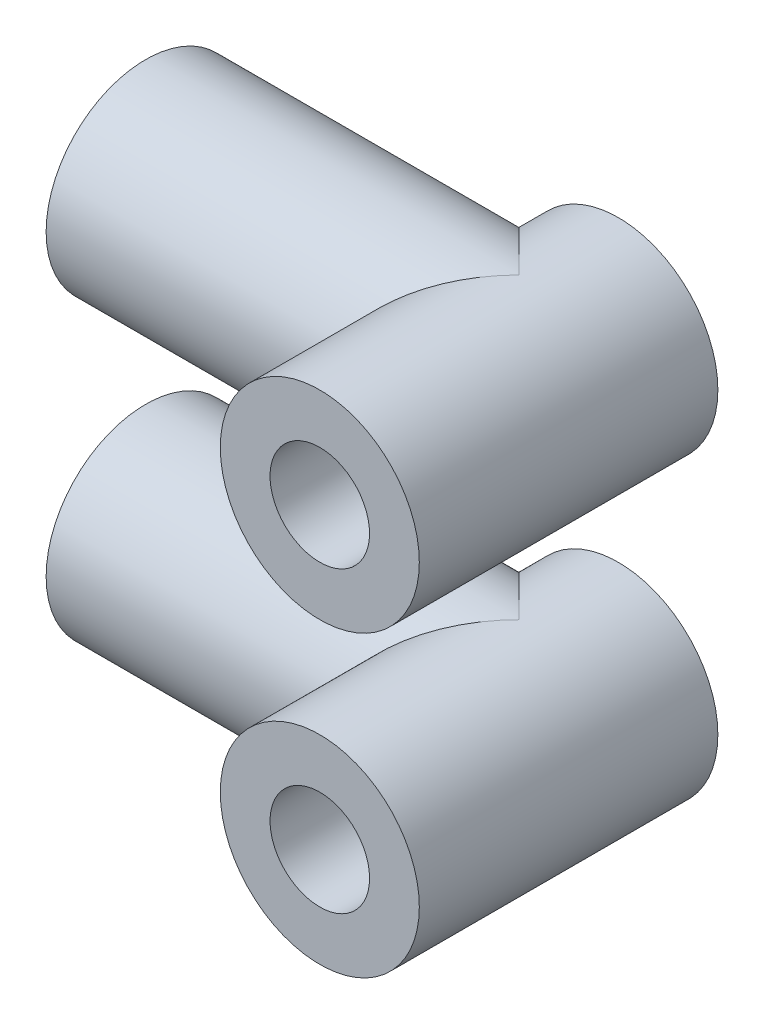
ISO-10303-21;
HEADER;
FILE_DESCRIPTION(('STEP AP214'),'2;1');
FILE_NAME('part.step','',(''),(''),'','','');
FILE_SCHEMA(('AUTOMOTIVE_DESIGN { 1 0 10303 214 1 1 1 1 }'));
ENDSEC;
DATA;
#1=APPLICATION_CONTEXT('core data for automotive mechanical design processes');
#2=APPLICATION_PROTOCOL_DEFINITION('international standard','automotive_design',2000,#1);
#3=PRODUCT_CONTEXT('',#1,'mechanical');
#4=PRODUCT('Part','Part','',(#3));
#5=PRODUCT_RELATED_PRODUCT_CATEGORY('part','',(#4));
#6=PRODUCT_DEFINITION_FORMATION('','',#4);
#7=PRODUCT_DEFINITION_CONTEXT('part definition',#1,'design');
#8=PRODUCT_DEFINITION('design','',#6,#7);
#9=PRODUCT_DEFINITION_SHAPE('','',#8);
#10=(LENGTH_UNIT() NAMED_UNIT(*) SI_UNIT(.MILLI.,.METRE.));
#11=(NAMED_UNIT(*) PLANE_ANGLE_UNIT() SI_UNIT($,.RADIAN.));
#12=(NAMED_UNIT(*) SI_UNIT($,.STERADIAN.) SOLID_ANGLE_UNIT());
#13=UNCERTAINTY_MEASURE_WITH_UNIT(LENGTH_MEASURE(1.E-05),#10,'distance_accuracy_value','');
#14=(GEOMETRIC_REPRESENTATION_CONTEXT(3) GLOBAL_UNCERTAINTY_ASSIGNED_CONTEXT((#13)) GLOBAL_UNIT_ASSIGNED_CONTEXT((#10,
#11,#12)) REPRESENTATION_CONTEXT('',''));
#15=CARTESIAN_POINT('',(0.,0.,0.));
#16=DIRECTION('',(0.,0.,1.));
#17=DIRECTION('',(1.,0.,0.));
#18=AXIS2_PLACEMENT_3D('',#15,#16,#17);
#19=CARTESIAN_POINT('',(0.,12.,12.));
#20=DIRECTION('',(0.,0.,1.));
#21=DIRECTION('',(1.,0.,0.));
#22=AXIS2_PLACEMENT_3D('',#19,#20,#21);
#23=PLANE('',#22);
#24=CARTESIAN_POINT('',(0.,12.,12.));
#25=DIRECTION('',(0.,0.,-1.));
#26=DIRECTION('',(1.,0.,0.));
#27=AXIS2_PLACEMENT_3D('',#24,#25,#26);
#28=CIRCLE('',#27,4.);
#29=CARTESIAN_POINT('',(4.,12.,12.));
#30=VERTEX_POINT('',#29);
#31=EDGE_CURVE('E12',#30,#30,#28,.T.);
#32=ORIENTED_EDGE('',*,*,#31,.F.);
#33=EDGE_LOOP('',(#32));
#34=FACE_BOUND('',#33,.T.);
#35=CARTESIAN_POINT('',(0.,12.,12.));
#36=DIRECTION('',(0.,0.,-1.));
#37=DIRECTION('',(1.,0.,0.));
#38=AXIS2_PLACEMENT_3D('',#35,#36,#37);
#39=CIRCLE('',#38,2.);
#40=CARTESIAN_POINT('',(2.,12.,12.));
#41=VERTEX_POINT('',#40);
#42=EDGE_CURVE('E95',#41,#41,#39,.T.);
#43=ORIENTED_EDGE('',*,*,#42,.T.);
#44=EDGE_LOOP('',(#43));
#45=FACE_BOUND('',#44,.T.);
#46=ADVANCED_FACE('F47',(#34,#45),#23,.T.);
#47=CARTESIAN_POINT('',(0.,12.,0.));
#48=DIRECTION('',(0.,0.,1.));
#49=DIRECTION('',(1.,0.,0.));
#50=AXIS2_PLACEMENT_3D('',#47,#48,#49);
#51=PLANE('',#50);
#52=CARTESIAN_POINT('',(0.,12.,0.));
#53=DIRECTION('',(0.,0.,-1.));
#54=DIRECTION('',(1.,0.,0.));
#55=AXIS2_PLACEMENT_3D('',#52,#53,#54);
#56=CIRCLE('',#55,2.);
#57=CARTESIAN_POINT('',(2.,12.,0.));
#58=VERTEX_POINT('',#57);
#59=EDGE_CURVE('E98',#58,#58,#56,.T.);
#60=ORIENTED_EDGE('',*,*,#59,.F.);
#61=EDGE_LOOP('',(#60));
#62=FACE_BOUND('',#61,.T.);
#63=CARTESIAN_POINT('',(0.,12.,0.));
#64=DIRECTION('',(0.,0.,-1.));
#65=DIRECTION('',(1.,0.,0.));
#66=AXIS2_PLACEMENT_3D('',#63,#64,#65);
#67=CIRCLE('',#66,4.);
#68=CARTESIAN_POINT('',(-4.,12.,0.));
#69=VERTEX_POINT('',#68);
#70=EDGE_CURVE('E51',#69,#69,#67,.T.);
#71=ORIENTED_EDGE('',*,*,#70,.T.);
#72=EDGE_LOOP('',(#71));
#73=FACE_BOUND('',#72,.T.);
#74=ADVANCED_FACE('F106',(#62,#73),#51,.F.);
#75=CARTESIAN_POINT('',(0.,12.,12.));
#76=DIRECTION('',(0.,0.,-1.));
#77=DIRECTION('',(-1.,0.,0.));
#78=AXIS2_PLACEMENT_3D('',#75,#76,#77);
#79=CYLINDRICAL_SURFACE('',#78,4.);
#80=ORIENTED_EDGE('',*,*,#31,.T.);
#81=EDGE_LOOP('',(#80));
#82=FACE_BOUND('',#81,.T.);
#83=CARTESIAN_POINT('',(0.,12.,4.));
#84=DIRECTION('',(0.707106781186547,0.,0.707106781186547));
#85=DIRECTION('',(0.707106781186547,0.,-0.707106781186547));
#86=AXIS2_PLACEMENT_3D('',#83,#84,#85);
#87=ELLIPSE('',#86,5.65685424949238,4.);
#88=CARTESIAN_POINT('',(0.,8.,4.));
#89=VERTEX_POINT('',#88);
#90=CARTESIAN_POINT('',(0.,16.,4.));
#91=VERTEX_POINT('',#90);
#92=EDGE_CURVE('E91',#89,#91,#87,.F.);
#93=ORIENTED_EDGE('',*,*,#92,.F.);
#94=CARTESIAN_POINT('',(0.,12.,4.));
#95=DIRECTION('',(-0.707106781186547,0.,0.707106781186547));
#96=DIRECTION('',(-0.707106781186547,0.,-0.707106781186547));
#97=AXIS2_PLACEMENT_3D('',#94,#95,#96);
#98=ELLIPSE('',#97,5.65685424949238,4.);
#99=EDGE_CURVE('E93',#69,#89,#98,.T.);
#100=ORIENTED_EDGE('',*,*,#99,.F.);
#101=ORIENTED_EDGE('',*,*,#70,.F.);
#102=EDGE_CURVE('E69',#91,#69,#98,.T.);
#103=ORIENTED_EDGE('',*,*,#102,.F.);
#104=EDGE_LOOP('',(#93,#100,#101,#103));
#105=FACE_BOUND('',#104,.T.);
#106=ADVANCED_FACE('F49',(#82,#105),#79,.T.);
#107=CARTESIAN_POINT('',(0.,12.,12.));
#108=DIRECTION('',(0.,0.,-1.));
#109=DIRECTION('',(-1.,0.,0.));
#110=AXIS2_PLACEMENT_3D('',#107,#108,#109);
#111=CYLINDRICAL_SURFACE('',#110,2.);
#112=CARTESIAN_POINT('',(0.,12.,4.));
#113=DIRECTION('',(0.707106781186547,0.,0.707106781186547));
#114=DIRECTION('',(0.707106781186547,0.,-0.707106781186547));
#115=AXIS2_PLACEMENT_3D('',#112,#113,#114);
#116=ELLIPSE('',#115,2.82842712474619,2.);
#117=CARTESIAN_POINT('',(0.,10.,4.));
#118=VERTEX_POINT('',#117);
#119=CARTESIAN_POINT('',(0.,14.,4.));
#120=VERTEX_POINT('',#119);
#121=EDGE_CURVE('E80',#118,#120,#116,.F.);
#122=ORIENTED_EDGE('',*,*,#121,.T.);
#123=CARTESIAN_POINT('',(0.,12.,4.));
#124=DIRECTION('',(-0.707106781186547,0.,0.707106781186547));
#125=DIRECTION('',(-0.707106781186547,0.,-0.707106781186547));
#126=AXIS2_PLACEMENT_3D('',#123,#124,#125);
#127=ELLIPSE('',#126,2.82842712474619,2.);
#128=EDGE_CURVE('E61',#120,#118,#127,.T.);
#129=ORIENTED_EDGE('',*,*,#128,.T.);
#130=EDGE_LOOP('',(#122,#129));
#131=FACE_BOUND('',#130,.T.);
#132=ORIENTED_EDGE('',*,*,#59,.T.);
#133=EDGE_LOOP('',(#132));
#134=FACE_BOUND('',#133,.T.);
#135=ORIENTED_EDGE('',*,*,#42,.F.);
#136=EDGE_LOOP('',(#135));
#137=FACE_BOUND('',#136,.T.);
#138=ADVANCED_FACE('F78',(#131,#134,#137),#111,.F.);
#139=CARTESIAN_POINT('',(-15.,12.,4.));
#140=DIRECTION('',(1.,0.,0.));
#141=DIRECTION('',(0.,0.,-1.));
#142=AXIS2_PLACEMENT_3D('',#139,#140,#141);
#143=CYLINDRICAL_SURFACE('',#142,4.);
#144=CARTESIAN_POINT('',(-15.,12.,4.));
#145=DIRECTION('',(-1.,0.,0.));
#146=DIRECTION('',(0.,0.,-1.));
#147=AXIS2_PLACEMENT_3D('',#144,#145,#146);
#148=CIRCLE('',#147,4.);
#149=CARTESIAN_POINT('',(-15.,12.,0.));
#150=VERTEX_POINT('',#149);
#151=EDGE_CURVE('E86',#150,#150,#148,.T.);
#152=ORIENTED_EDGE('',*,*,#151,.F.);
#153=EDGE_LOOP('',(#152));
#154=FACE_BOUND('',#153,.T.);
#155=ORIENTED_EDGE('',*,*,#102,.T.);
#156=ORIENTED_EDGE('',*,*,#99,.T.);
#157=ORIENTED_EDGE('',*,*,#92,.T.);
#158=EDGE_LOOP('',(#155,#156,#157));
#159=FACE_BOUND('',#158,.T.);
#160=ADVANCED_FACE('F103',(#154,#159),#143,.T.);
#161=CARTESIAN_POINT('',(-15.,12.,4.));
#162=DIRECTION('',(1.,0.,0.));
#163=DIRECTION('',(0.,0.,-1.));
#164=AXIS2_PLACEMENT_3D('',#161,#162,#163);
#165=CYLINDRICAL_SURFACE('',#164,2.);
#166=CARTESIAN_POINT('',(-15.,12.,4.));
#167=DIRECTION('',(-1.,0.,0.));
#168=DIRECTION('',(0.,0.,-1.));
#169=AXIS2_PLACEMENT_3D('',#166,#167,#168);
#170=CIRCLE('',#169,2.);
#171=CARTESIAN_POINT('',(-15.,12.,2.));
#172=VERTEX_POINT('',#171);
#173=EDGE_CURVE('E83',#172,#172,#170,.T.);
#174=ORIENTED_EDGE('',*,*,#173,.T.);
#175=EDGE_LOOP('',(#174));
#176=FACE_BOUND('',#175,.T.);
#177=ORIENTED_EDGE('',*,*,#121,.F.);
#178=ORIENTED_EDGE('',*,*,#128,.F.);
#179=EDGE_LOOP('',(#177,#178));
#180=FACE_BOUND('',#179,.T.);
#181=ADVANCED_FACE('F82',(#176,#180),#165,.F.);
#182=CARTESIAN_POINT('',(-15.,12.,4.));
#183=DIRECTION('',(1.,0.,0.));
#184=DIRECTION('',(0.,0.,-1.));
#185=AXIS2_PLACEMENT_3D('',#182,#183,#184);
#186=PLANE('',#185);
#187=ORIENTED_EDGE('',*,*,#173,.F.);
#188=EDGE_LOOP('',(#187));
#189=FACE_BOUND('',#188,.T.);
#190=ORIENTED_EDGE('',*,*,#151,.T.);
#191=EDGE_LOOP('',(#190));
#192=FACE_BOUND('',#191,.T.);
#193=ADVANCED_FACE('F122',(#189,#192),#186,.F.);
#194=CLOSED_SHELL('',(#46,#74,#106,#138,#160,#181,#193));
#195=MANIFOLD_SOLID_BREP('B2_NOT_SHOWN',#194);
#196=CARTESIAN_POINT('',(0.,0.,12.));
#197=DIRECTION('',(0.,0.,1.));
#198=DIRECTION('',(1.,0.,0.));
#199=AXIS2_PLACEMENT_3D('',#196,#197,#198);
#200=PLANE('',#199);
#201=CARTESIAN_POINT('',(0.,0.,12.));
#202=DIRECTION('',(0.,0.,1.));
#203=DIRECTION('',(1.,0.,0.));
#204=AXIS2_PLACEMENT_3D('',#201,#202,#203);
#205=CIRCLE('',#204,4.);
#206=CARTESIAN_POINT('',(4.,0.,12.));
#207=VERTEX_POINT('',#206);
#208=EDGE_CURVE('E45',#207,#207,#205,.T.);
#209=ORIENTED_EDGE('',*,*,#208,.T.);
#210=EDGE_LOOP('',(#209));
#211=FACE_BOUND('',#210,.T.);
#212=CARTESIAN_POINT('',(0.,0.,12.));
#213=DIRECTION('',(0.,0.,1.));
#214=DIRECTION('',(1.,0.,0.));
#215=AXIS2_PLACEMENT_3D('',#212,#213,#214);
#216=CIRCLE('',#215,2.);
#217=CARTESIAN_POINT('',(2.,0.,12.));
#218=VERTEX_POINT('',#217);
#219=EDGE_CURVE('E231',#218,#218,#216,.T.);
#220=ORIENTED_EDGE('',*,*,#219,.F.);
#221=EDGE_LOOP('',(#220));
#222=FACE_BOUND('',#221,.T.);
#223=ADVANCED_FACE('F183',(#211,#222),#200,.T.);
#224=CARTESIAN_POINT('',(0.,0.,0.));
#225=DIRECTION('',(0.,0.,1.));
#226=DIRECTION('',(1.,0.,0.));
#227=AXIS2_PLACEMENT_3D('',#224,#225,#226);
#228=PLANE('',#227);
#229=CARTESIAN_POINT('',(0.,0.,0.));
#230=DIRECTION('',(0.,0.,1.));
#231=DIRECTION('',(1.,0.,0.));
#232=AXIS2_PLACEMENT_3D('',#229,#230,#231);
#233=CIRCLE('',#232,2.);
#234=CARTESIAN_POINT('',(2.,0.,0.));
#235=VERTEX_POINT('',#234);
#236=EDGE_CURVE('E234',#235,#235,#233,.T.);
#237=ORIENTED_EDGE('',*,*,#236,.T.);
#238=EDGE_LOOP('',(#237));
#239=FACE_BOUND('',#238,.T.);
#240=CARTESIAN_POINT('',(0.,0.,0.));
#241=DIRECTION('',(0.,0.,1.));
#242=DIRECTION('',(1.,0.,0.));
#243=AXIS2_PLACEMENT_3D('',#240,#241,#242);
#244=CIRCLE('',#243,4.);
#245=CARTESIAN_POINT('',(-4.,0.,0.));
#246=VERTEX_POINT('',#245);
#247=EDGE_CURVE('E187',#246,#246,#244,.T.);
#248=ORIENTED_EDGE('',*,*,#247,.F.);
#249=EDGE_LOOP('',(#248));
#250=FACE_BOUND('',#249,.T.);
#251=ADVANCED_FACE('F255',(#239,#250),#228,.F.);
#252=CARTESIAN_POINT('',(0.,0.,12.));
#253=DIRECTION('',(0.,0.,-1.));
#254=DIRECTION('',(-1.,0.,0.));
#255=AXIS2_PLACEMENT_3D('',#252,#253,#254);
#256=CYLINDRICAL_SURFACE('',#255,4.);
#257=ORIENTED_EDGE('',*,*,#208,.F.);
#258=EDGE_LOOP('',(#257));
#259=FACE_BOUND('',#258,.T.);
#260=CARTESIAN_POINT('',(0.,0.,4.));
#261=DIRECTION('',(-0.707106781186547,0.,-0.707106781186547));
#262=DIRECTION('',(0.707106781186547,0.,-0.707106781186547));
#263=AXIS2_PLACEMENT_3D('',#260,#261,#262);
#264=ELLIPSE('',#263,5.65685424949238,4.);
#265=CARTESIAN_POINT('',(0.,4.,4.));
#266=VERTEX_POINT('',#265);
#267=CARTESIAN_POINT('',(0.,-4.,4.));
#268=VERTEX_POINT('',#267);
#269=EDGE_CURVE('E226',#266,#268,#264,.F.);
#270=ORIENTED_EDGE('',*,*,#269,.T.);
#271=CARTESIAN_POINT('',(0.,0.,4.));
#272=DIRECTION('',(0.707106781186547,0.,-0.707106781186547));
#273=DIRECTION('',(-0.707106781186547,0.,-0.707106781186547));
#274=AXIS2_PLACEMENT_3D('',#271,#272,#273);
#275=ELLIPSE('',#274,5.65685424949238,4.);
#276=EDGE_CURVE('E205',#268,#246,#275,.T.);
#277=ORIENTED_EDGE('',*,*,#276,.T.);
#278=ORIENTED_EDGE('',*,*,#247,.T.);
#279=EDGE_CURVE('E228',#246,#266,#275,.T.);
#280=ORIENTED_EDGE('',*,*,#279,.T.);
#281=EDGE_LOOP('',(#270,#277,#278,#280));
#282=FACE_BOUND('',#281,.T.);
#283=ADVANCED_FACE('F185',(#259,#282),#256,.T.);
#284=CARTESIAN_POINT('',(0.,0.,12.));
#285=DIRECTION('',(0.,0.,-1.));
#286=DIRECTION('',(-1.,0.,0.));
#287=AXIS2_PLACEMENT_3D('',#284,#285,#286);
#288=CYLINDRICAL_SURFACE('',#287,2.);
#289=CARTESIAN_POINT('',(0.,0.,4.));
#290=DIRECTION('',(-0.707106781186547,0.,-0.707106781186547));
#291=DIRECTION('',(0.707106781186547,0.,-0.707106781186547));
#292=AXIS2_PLACEMENT_3D('',#289,#290,#291);
#293=ELLIPSE('',#292,2.82842712474619,2.);
#294=CARTESIAN_POINT('',(0.,2.,4.));
#295=VERTEX_POINT('',#294);
#296=CARTESIAN_POINT('',(0.,-2.,4.));
#297=VERTEX_POINT('',#296);
#298=EDGE_CURVE('E197',#295,#297,#293,.F.);
#299=ORIENTED_EDGE('',*,*,#298,.F.);
#300=CARTESIAN_POINT('',(0.,0.,4.));
#301=DIRECTION('',(0.707106781186547,0.,-0.707106781186547));
#302=DIRECTION('',(-0.707106781186547,0.,-0.707106781186547));
#303=AXIS2_PLACEMENT_3D('',#300,#301,#302);
#304=ELLIPSE('',#303,2.82842712474619,2.);
#305=EDGE_CURVE('E212',#297,#295,#304,.T.);
#306=ORIENTED_EDGE('',*,*,#305,.F.);
#307=EDGE_LOOP('',(#299,#306));
#308=FACE_BOUND('',#307,.T.);
#309=ORIENTED_EDGE('',*,*,#236,.F.);
#310=EDGE_LOOP('',(#309));
#311=FACE_BOUND('',#310,.T.);
#312=ORIENTED_EDGE('',*,*,#219,.T.);
#313=EDGE_LOOP('',(#312));
#314=FACE_BOUND('',#313,.T.);
#315=ADVANCED_FACE('F216',(#308,#311,#314),#288,.F.);
#316=CARTESIAN_POINT('',(-15.,0.,4.));
#317=DIRECTION('',(1.,0.,0.));
#318=DIRECTION('',(0.,0.,-1.));
#319=AXIS2_PLACEMENT_3D('',#316,#317,#318);
#320=CYLINDRICAL_SURFACE('',#319,4.);
#321=CARTESIAN_POINT('',(-15.,0.,4.));
#322=DIRECTION('',(1.,0.,0.));
#323=DIRECTION('',(0.,0.,-1.));
#324=AXIS2_PLACEMENT_3D('',#321,#322,#323);
#325=CIRCLE('',#324,4.);
#326=CARTESIAN_POINT('',(-15.,0.,0.));
#327=VERTEX_POINT('',#326);
#328=EDGE_CURVE('E221',#327,#327,#325,.T.);
#329=ORIENTED_EDGE('',*,*,#328,.T.);
#330=EDGE_LOOP('',(#329));
#331=FACE_BOUND('',#330,.T.);
#332=ORIENTED_EDGE('',*,*,#276,.F.);
#333=ORIENTED_EDGE('',*,*,#269,.F.);
#334=ORIENTED_EDGE('',*,*,#279,.F.);
#335=EDGE_LOOP('',(#332,#333,#334));
#336=FACE_BOUND('',#335,.T.);
#337=ADVANCED_FACE('F241',(#331,#336),#320,.T.);
#338=CARTESIAN_POINT('',(-15.,0.,4.));
#339=DIRECTION('',(1.,0.,0.));
#340=DIRECTION('',(0.,0.,-1.));
#341=AXIS2_PLACEMENT_3D('',#338,#339,#340);
#342=CYLINDRICAL_SURFACE('',#341,2.);
#343=CARTESIAN_POINT('',(-15.,0.,4.));
#344=DIRECTION('',(1.,0.,0.));
#345=DIRECTION('',(0.,0.,-1.));
#346=AXIS2_PLACEMENT_3D('',#343,#344,#345);
#347=CIRCLE('',#346,2.);
#348=CARTESIAN_POINT('',(-15.,0.,2.));
#349=VERTEX_POINT('',#348);
#350=EDGE_CURVE('E218',#349,#349,#347,.T.);
#351=ORIENTED_EDGE('',*,*,#350,.F.);
#352=EDGE_LOOP('',(#351));
#353=FACE_BOUND('',#352,.T.);
#354=ORIENTED_EDGE('',*,*,#298,.T.);
#355=ORIENTED_EDGE('',*,*,#305,.T.);
#356=EDGE_LOOP('',(#354,#355));
#357=FACE_BOUND('',#356,.T.);
#358=ADVANCED_FACE('F213',(#353,#357),#342,.F.);
#359=CARTESIAN_POINT('',(-15.,0.,4.));
#360=DIRECTION('',(1.,0.,0.));
#361=DIRECTION('',(0.,0.,-1.));
#362=AXIS2_PLACEMENT_3D('',#359,#360,#361);
#363=PLANE('',#362);
#364=ORIENTED_EDGE('',*,*,#350,.T.);
#365=EDGE_LOOP('',(#364));
#366=FACE_BOUND('',#365,.T.);
#367=ORIENTED_EDGE('',*,*,#328,.F.);
#368=EDGE_LOOP('',(#367));
#369=FACE_BOUND('',#368,.T.);
#370=ADVANCED_FACE('F249',(#366,#369),#363,.F.);
#371=CLOSED_SHELL('',(#223,#251,#283,#315,#337,#358,#370));
#372=MANIFOLD_SOLID_BREP('B6',#371);
#373=ADVANCED_BREP_SHAPE_REPRESENTATION('',(#18,#195,#372),#14);
#374=SHAPE_DEFINITION_REPRESENTATION(#9,#373);
ENDSEC;
END-ISO-10303-21;
